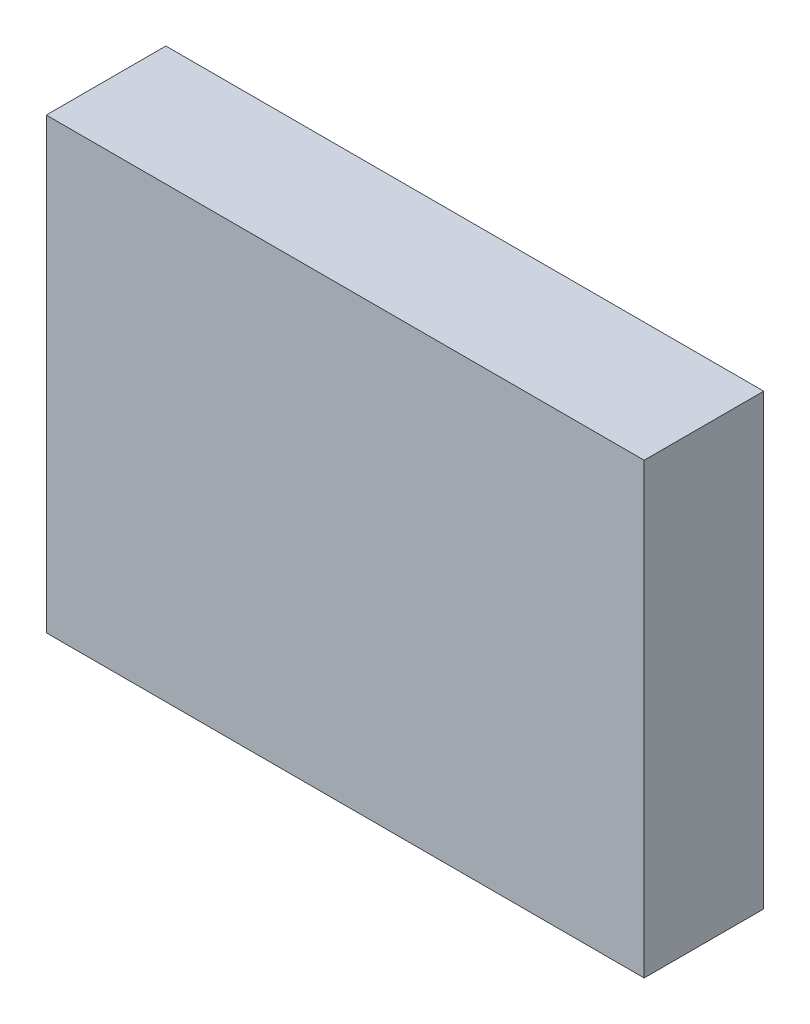
ISO-10303-21;
HEADER;
FILE_DESCRIPTION(('STEP AP214'),'2;1');
FILE_NAME('part.step','',(''),(''),'','','');
FILE_SCHEMA(('AUTOMOTIVE_DESIGN { 1 0 10303 214 1 1 1 1 }'));
ENDSEC;
DATA;
#1=APPLICATION_CONTEXT('core data for automotive mechanical design processes');
#2=APPLICATION_PROTOCOL_DEFINITION('international standard','automotive_design',2000,#1);
#3=PRODUCT_CONTEXT('',#1,'mechanical');
#4=PRODUCT('Part','Part','',(#3));
#5=PRODUCT_RELATED_PRODUCT_CATEGORY('part','',(#4));
#6=PRODUCT_DEFINITION_FORMATION('','',#4);
#7=PRODUCT_DEFINITION_CONTEXT('part definition',#1,'design');
#8=PRODUCT_DEFINITION('design','',#6,#7);
#9=PRODUCT_DEFINITION_SHAPE('','',#8);
#10=(LENGTH_UNIT() NAMED_UNIT(*) SI_UNIT(.MILLI.,.METRE.));
#11=(NAMED_UNIT(*) PLANE_ANGLE_UNIT() SI_UNIT($,.RADIAN.));
#12=(NAMED_UNIT(*) SI_UNIT($,.STERADIAN.) SOLID_ANGLE_UNIT());
#13=UNCERTAINTY_MEASURE_WITH_UNIT(LENGTH_MEASURE(1.E-05),#10,'distance_accuracy_value','');
#14=(GEOMETRIC_REPRESENTATION_CONTEXT(3) GLOBAL_UNCERTAINTY_ASSIGNED_CONTEXT((#13)) GLOBAL_UNIT_ASSIGNED_CONTEXT((#10,
#11,#12)) REPRESENTATION_CONTEXT('',''));
#15=CARTESIAN_POINT('',(0.,0.,0.));
#16=DIRECTION('',(0.,0.,1.));
#17=DIRECTION('',(1.,0.,0.));
#18=AXIS2_PLACEMENT_3D('',#15,#16,#17);
#19=CARTESIAN_POINT('',(50.,-37.5,10.));
#20=DIRECTION('',(-1.,0.,0.));
#21=DIRECTION('',(0.,0.,1.));
#22=AXIS2_PLACEMENT_3D('',#19,#20,#21);
#23=PLANE('',#22);
#24=DIRECTION('',(0.,1.,0.));
#25=VECTOR('',#24,1.);
#26=CARTESIAN_POINT('',(50.,-37.5,-10.));
#27=LINE('',#26,#25);
#28=CARTESIAN_POINT('',(50.,-37.5,-10.));
#29=VERTEX_POINT('',#28);
#30=CARTESIAN_POINT('',(50.,37.5,-10.));
#31=VERTEX_POINT('',#30);
#32=EDGE_CURVE('E98',#29,#31,#27,.T.);
#33=ORIENTED_EDGE('',*,*,#32,.T.);
#34=DIRECTION('',(0.,0.,-1.));
#35=VECTOR('',#34,1.);
#36=CARTESIAN_POINT('',(50.,37.5,10.));
#37=LINE('',#36,#35);
#38=CARTESIAN_POINT('',(50.,37.5,10.));
#39=VERTEX_POINT('',#38);
#40=EDGE_CURVE('E11',#39,#31,#37,.T.);
#41=ORIENTED_EDGE('',*,*,#40,.F.);
#42=DIRECTION('',(0.,1.,0.));
#43=VECTOR('',#42,1.);
#44=CARTESIAN_POINT('',(50.,-37.5,10.));
#45=LINE('',#44,#43);
#46=CARTESIAN_POINT('',(50.,-37.5,10.));
#47=VERTEX_POINT('',#46);
#48=EDGE_CURVE('E86',#47,#39,#45,.T.);
#49=ORIENTED_EDGE('',*,*,#48,.F.);
#50=DIRECTION('',(0.,0.,-1.));
#51=VECTOR('',#50,1.);
#52=CARTESIAN_POINT('',(50.,-37.5,10.));
#53=LINE('',#52,#51);
#54=EDGE_CURVE('E94',#47,#29,#53,.T.);
#55=ORIENTED_EDGE('',*,*,#54,.T.);
#56=EDGE_LOOP('',(#33,#41,#49,#55));
#57=FACE_BOUND('',#56,.T.);
#58=ADVANCED_FACE('F35',(#57),#23,.F.);
#59=CARTESIAN_POINT('',(-50.,37.5,10.));
#60=DIRECTION('',(0.,-1.,0.));
#61=DIRECTION('',(0.,0.,-1.));
#62=AXIS2_PLACEMENT_3D('',#59,#60,#61);
#63=PLANE('',#62);
#64=DIRECTION('',(-1.,0.,0.));
#65=VECTOR('',#64,1.);
#66=CARTESIAN_POINT('',(-50.,37.5,-10.));
#67=LINE('',#66,#65);
#68=CARTESIAN_POINT('',(-50.,37.5,-10.));
#69=VERTEX_POINT('',#68);
#70=EDGE_CURVE('E90',#31,#69,#67,.T.);
#71=ORIENTED_EDGE('',*,*,#70,.T.);
#72=DIRECTION('',(0.,0.,-1.));
#73=VECTOR('',#72,1.);
#74=CARTESIAN_POINT('',(-50.,37.5,10.));
#75=LINE('',#74,#73);
#76=CARTESIAN_POINT('',(-50.,37.5,10.));
#77=VERTEX_POINT('',#76);
#78=EDGE_CURVE('E43',#77,#69,#75,.T.);
#79=ORIENTED_EDGE('',*,*,#78,.F.);
#80=DIRECTION('',(-1.,0.,0.));
#81=VECTOR('',#80,1.);
#82=CARTESIAN_POINT('',(-50.,37.5,10.));
#83=LINE('',#82,#81);
#84=EDGE_CURVE('E81',#39,#77,#83,.T.);
#85=ORIENTED_EDGE('',*,*,#84,.F.);
#86=ORIENTED_EDGE('',*,*,#40,.T.);
#87=EDGE_LOOP('',(#71,#79,#85,#86));
#88=FACE_BOUND('',#87,.T.);
#89=ADVANCED_FACE('F89',(#88),#63,.F.);
#90=CARTESIAN_POINT('',(-50.,-37.5,10.));
#91=DIRECTION('',(1.,0.,0.));
#92=DIRECTION('',(0.,0.,-1.));
#93=AXIS2_PLACEMENT_3D('',#90,#91,#92);
#94=PLANE('',#93);
#95=DIRECTION('',(0.,-1.,0.));
#96=VECTOR('',#95,1.);
#97=CARTESIAN_POINT('',(-50.,-37.5,-10.));
#98=LINE('',#97,#96);
#99=CARTESIAN_POINT('',(-50.,-37.5,-10.));
#100=VERTEX_POINT('',#99);
#101=EDGE_CURVE('E68',#69,#100,#98,.T.);
#102=ORIENTED_EDGE('',*,*,#101,.T.);
#103=DIRECTION('',(0.,0.,-1.));
#104=VECTOR('',#103,1.);
#105=CARTESIAN_POINT('',(-50.,-37.5,10.));
#106=LINE('',#105,#104);
#107=CARTESIAN_POINT('',(-50.,-37.5,10.));
#108=VERTEX_POINT('',#107);
#109=EDGE_CURVE('E91',#108,#100,#106,.T.);
#110=ORIENTED_EDGE('',*,*,#109,.F.);
#111=DIRECTION('',(0.,-1.,0.));
#112=VECTOR('',#111,1.);
#113=CARTESIAN_POINT('',(-50.,-37.5,10.));
#114=LINE('',#113,#112);
#115=EDGE_CURVE('E84',#77,#108,#114,.T.);
#116=ORIENTED_EDGE('',*,*,#115,.F.);
#117=ORIENTED_EDGE('',*,*,#78,.T.);
#118=EDGE_LOOP('',(#102,#110,#116,#117));
#119=FACE_BOUND('',#118,.T.);
#120=ADVANCED_FACE('F92',(#119),#94,.F.);
#121=CARTESIAN_POINT('',(-50.,-37.5,10.));
#122=DIRECTION('',(0.,1.,0.));
#123=DIRECTION('',(0.,0.,1.));
#124=AXIS2_PLACEMENT_3D('',#121,#122,#123);
#125=PLANE('',#124);
#126=DIRECTION('',(1.,0.,0.));
#127=VECTOR('',#126,1.);
#128=CARTESIAN_POINT('',(-50.,-37.5,-10.));
#129=LINE('',#128,#127);
#130=EDGE_CURVE('E74',#100,#29,#129,.T.);
#131=ORIENTED_EDGE('',*,*,#130,.T.);
#132=ORIENTED_EDGE('',*,*,#54,.F.);
#133=DIRECTION('',(1.,0.,0.));
#134=VECTOR('',#133,1.);
#135=CARTESIAN_POINT('',(-50.,-37.5,10.));
#136=LINE('',#135,#134);
#137=EDGE_CURVE('E51',#108,#47,#136,.T.);
#138=ORIENTED_EDGE('',*,*,#137,.F.);
#139=ORIENTED_EDGE('',*,*,#109,.T.);
#140=EDGE_LOOP('',(#131,#132,#138,#139));
#141=FACE_BOUND('',#140,.T.);
#142=ADVANCED_FACE('F105',(#141),#125,.F.);
#143=CARTESIAN_POINT('',(0.,0.,10.));
#144=DIRECTION('',(0.,0.,-1.));
#145=DIRECTION('',(-1.,0.,0.));
#146=AXIS2_PLACEMENT_3D('',#143,#144,#145);
#147=PLANE('',#146);
#148=ORIENTED_EDGE('',*,*,#48,.T.);
#149=ORIENTED_EDGE('',*,*,#84,.T.);
#150=ORIENTED_EDGE('',*,*,#115,.T.);
#151=ORIENTED_EDGE('',*,*,#137,.T.);
#152=EDGE_LOOP('',(#148,#149,#150,#151));
#153=FACE_BOUND('',#152,.T.);
#154=ADVANCED_FACE('F82',(#153),#147,.F.);
#155=CARTESIAN_POINT('',(0.,0.,-10.));
#156=DIRECTION('',(0.,0.,-1.));
#157=DIRECTION('',(-1.,0.,0.));
#158=AXIS2_PLACEMENT_3D('',#155,#156,#157);
#159=PLANE('',#158);
#160=ORIENTED_EDGE('',*,*,#32,.F.);
#161=ORIENTED_EDGE('',*,*,#130,.F.);
#162=ORIENTED_EDGE('',*,*,#101,.F.);
#163=ORIENTED_EDGE('',*,*,#70,.F.);
#164=EDGE_LOOP('',(#160,#161,#162,#163));
#165=FACE_BOUND('',#164,.T.);
#166=ADVANCED_FACE('F108',(#165),#159,.T.);
#167=CLOSED_SHELL('',(#58,#89,#120,#142,#154,#166));
#168=MANIFOLD_SOLID_BREP('B2',#167);
#169=ADVANCED_BREP_SHAPE_REPRESENTATION('',(#18,#168),#14);
#170=SHAPE_DEFINITION_REPRESENTATION(#9,#169);
ENDSEC;
END-ISO-10303-21;
